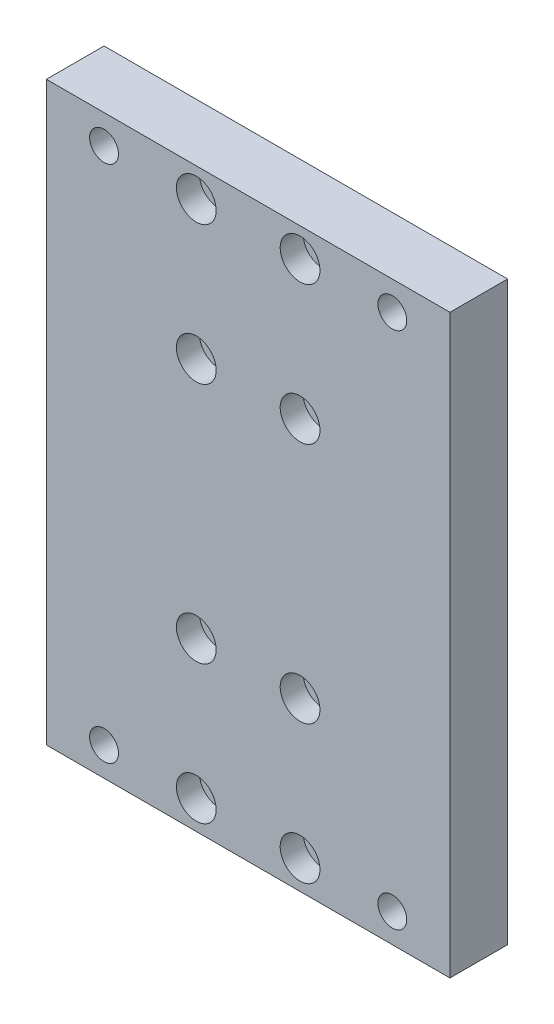
ISO-10303-21;
HEADER;
FILE_DESCRIPTION(('STEP AP214'),'2;1');
FILE_NAME('part.step','',(''),(''),'','','');
FILE_SCHEMA(('AUTOMOTIVE_DESIGN { 1 0 10303 214 1 1 1 1 }'));
ENDSEC;
DATA;
#1=APPLICATION_CONTEXT('core data for automotive mechanical design processes');
#2=APPLICATION_PROTOCOL_DEFINITION('international standard','automotive_design',2000,#1);
#3=PRODUCT_CONTEXT('',#1,'mechanical');
#4=PRODUCT('Part','Part','',(#3));
#5=PRODUCT_RELATED_PRODUCT_CATEGORY('part','',(#4));
#6=PRODUCT_DEFINITION_FORMATION('','',#4);
#7=PRODUCT_DEFINITION_CONTEXT('part definition',#1,'design');
#8=PRODUCT_DEFINITION('design','',#6,#7);
#9=PRODUCT_DEFINITION_SHAPE('','',#8);
#10=(LENGTH_UNIT() NAMED_UNIT(*) SI_UNIT(.MILLI.,.METRE.));
#11=(NAMED_UNIT(*) PLANE_ANGLE_UNIT() SI_UNIT($,.RADIAN.));
#12=(NAMED_UNIT(*) SI_UNIT($,.STERADIAN.) SOLID_ANGLE_UNIT());
#13=UNCERTAINTY_MEASURE_WITH_UNIT(LENGTH_MEASURE(1.E-05),#10,'distance_accuracy_value','');
#14=(GEOMETRIC_REPRESENTATION_CONTEXT(3) GLOBAL_UNCERTAINTY_ASSIGNED_CONTEXT((#13)) GLOBAL_UNIT_ASSIGNED_CONTEXT((#10,
#11,#12)) REPRESENTATION_CONTEXT('',''));
#15=CARTESIAN_POINT('',(0.,0.,0.));
#16=DIRECTION('',(0.,0.,1.));
#17=DIRECTION('',(1.,0.,0.));
#18=AXIS2_PLACEMENT_3D('',#15,#16,#17);
#19=CARTESIAN_POINT('',(-9.00000000000006,-20.9999999999998,10.));
#20=DIRECTION('',(0.,0.,-1.));
#21=DIRECTION('',(-1.,0.,0.));
#22=AXIS2_PLACEMENT_3D('',#19,#20,#21);
#23=CYLINDRICAL_SURFACE('',#22,1.5);
#24=CARTESIAN_POINT('',(-9.00000000000006,-20.9999999999998,0.));
#25=DIRECTION('',(0.,0.,-1.));
#26=DIRECTION('',(-1.,0.,0.));
#27=AXIS2_PLACEMENT_3D('',#24,#25,#26);
#28=CIRCLE('',#27,1.5);
#29=CARTESIAN_POINT('',(-10.5000000000001,-20.9999999999998,0.));
#30=VERTEX_POINT('',#29);
#31=EDGE_CURVE('E145',#30,#30,#28,.T.);
#32=ORIENTED_EDGE('',*,*,#31,.T.);
#33=EDGE_LOOP('',(#32));
#34=FACE_BOUND('',#33,.T.);
#35=CARTESIAN_POINT('',(-9.00000000000006,-20.9999999999998,6.));
#36=DIRECTION('',(0.,0.,1.));
#37=DIRECTION('',(1.,0.,0.));
#38=AXIS2_PLACEMENT_3D('',#35,#36,#37);
#39=CIRCLE('',#38,1.5);
#40=CARTESIAN_POINT('',(-7.50000000000006,-20.9999999999998,6.));
#41=VERTEX_POINT('',#40);
#42=EDGE_CURVE('E131',#41,#41,#39,.F.);
#43=ORIENTED_EDGE('',*,*,#42,.F.);
#44=EDGE_LOOP('',(#43));
#45=FACE_BOUND('',#44,.T.);
#46=ADVANCED_FACE('F37',(#34,#45),#23,.F.);
#47=CARTESIAN_POINT('',(8.99999999999985,-44.9999999999998,10.));
#48=DIRECTION('',(0.,0.,-1.));
#49=DIRECTION('',(-1.,0.,0.));
#50=AXIS2_PLACEMENT_3D('',#47,#48,#49);
#51=CYLINDRICAL_SURFACE('',#50,1.5);
#52=CARTESIAN_POINT('',(8.99999999999985,-44.9999999999998,0.));
#53=DIRECTION('',(0.,0.,-1.));
#54=DIRECTION('',(-1.,0.,0.));
#55=AXIS2_PLACEMENT_3D('',#52,#53,#54);
#56=CIRCLE('',#55,1.5);
#57=CARTESIAN_POINT('',(7.49999999999985,-44.9999999999998,0.));
#58=VERTEX_POINT('',#57);
#59=EDGE_CURVE('E140',#58,#58,#56,.T.);
#60=ORIENTED_EDGE('',*,*,#59,.T.);
#61=EDGE_LOOP('',(#60));
#62=FACE_BOUND('',#61,.T.);
#63=CARTESIAN_POINT('',(8.99999999999985,-44.9999999999998,6.));
#64=DIRECTION('',(0.,0.,1.));
#65=DIRECTION('',(1.,0.,0.));
#66=AXIS2_PLACEMENT_3D('',#63,#64,#65);
#67=CIRCLE('',#66,1.5);
#68=CARTESIAN_POINT('',(10.4999999999998,-44.9999999999998,6.));
#69=VERTEX_POINT('',#68);
#70=EDGE_CURVE('E129',#69,#69,#67,.F.);
#71=ORIENTED_EDGE('',*,*,#70,.F.);
#72=EDGE_LOOP('',(#71));
#73=FACE_BOUND('',#72,.T.);
#74=ADVANCED_FACE('F213',(#62,#73),#51,.F.);
#75=CARTESIAN_POINT('',(-8.99999999999984,45.0000000000002,10.));
#76=DIRECTION('',(0.,0.,-1.));
#77=DIRECTION('',(-1.,0.,0.));
#78=AXIS2_PLACEMENT_3D('',#75,#76,#77);
#79=CYLINDRICAL_SURFACE('',#78,1.5);
#80=CARTESIAN_POINT('',(-8.99999999999984,45.0000000000002,0.));
#81=DIRECTION('',(0.,0.,-1.));
#82=DIRECTION('',(-1.,0.,0.));
#83=AXIS2_PLACEMENT_3D('',#80,#81,#82);
#84=CIRCLE('',#83,1.5);
#85=CARTESIAN_POINT('',(-10.4999999999998,45.0000000000002,0.));
#86=VERTEX_POINT('',#85);
#87=EDGE_CURVE('E160',#86,#86,#84,.T.);
#88=ORIENTED_EDGE('',*,*,#87,.T.);
#89=EDGE_LOOP('',(#88));
#90=FACE_BOUND('',#89,.T.);
#91=CARTESIAN_POINT('',(-8.99999999999984,45.0000000000002,6.));
#92=DIRECTION('',(0.,0.,1.));
#93=DIRECTION('',(1.,0.,0.));
#94=AXIS2_PLACEMENT_3D('',#91,#92,#93);
#95=CIRCLE('',#94,1.5);
#96=CARTESIAN_POINT('',(-7.49999999999983,45.0000000000002,6.));
#97=VERTEX_POINT('',#96);
#98=EDGE_CURVE('E123',#97,#97,#95,.F.);
#99=ORIENTED_EDGE('',*,*,#98,.F.);
#100=EDGE_LOOP('',(#99));
#101=FACE_BOUND('',#100,.T.);
#102=ADVANCED_FACE('F220',(#90,#101),#79,.F.);
#103=CARTESIAN_POINT('',(9.00000000000008,21.0000000000002,10.));
#104=DIRECTION('',(0.,0.,-1.));
#105=DIRECTION('',(-1.,0.,0.));
#106=AXIS2_PLACEMENT_3D('',#103,#104,#105);
#107=CYLINDRICAL_SURFACE('',#106,1.5);
#108=CARTESIAN_POINT('',(9.00000000000008,21.0000000000002,0.));
#109=DIRECTION('',(0.,0.,-1.));
#110=DIRECTION('',(-1.,0.,0.));
#111=AXIS2_PLACEMENT_3D('',#108,#109,#110);
#112=CIRCLE('',#111,1.5);
#113=CARTESIAN_POINT('',(7.50000000000007,21.0000000000002,0.));
#114=VERTEX_POINT('',#113);
#115=EDGE_CURVE('E157',#114,#114,#112,.T.);
#116=ORIENTED_EDGE('',*,*,#115,.T.);
#117=EDGE_LOOP('',(#116));
#118=FACE_BOUND('',#117,.T.);
#119=CARTESIAN_POINT('',(9.00000000000008,21.0000000000002,6.));
#120=DIRECTION('',(0.,0.,1.));
#121=DIRECTION('',(1.,0.,0.));
#122=AXIS2_PLACEMENT_3D('',#119,#120,#121);
#123=CIRCLE('',#122,1.5);
#124=CARTESIAN_POINT('',(10.5000000000001,21.0000000000002,6.));
#125=VERTEX_POINT('',#124);
#126=EDGE_CURVE('E120',#125,#125,#123,.F.);
#127=ORIENTED_EDGE('',*,*,#126,.F.);
#128=EDGE_LOOP('',(#127));
#129=FACE_BOUND('',#128,.T.);
#130=ADVANCED_FACE('F239',(#118,#129),#107,.F.);
#131=CARTESIAN_POINT('',(-35.,-50.,10.));
#132=DIRECTION('',(1.,0.,0.));
#133=DIRECTION('',(0.,0.,-1.));
#134=AXIS2_PLACEMENT_3D('',#131,#132,#133);
#135=PLANE('',#134);
#136=DIRECTION('',(0.,-1.,0.));
#137=VECTOR('',#136,1.);
#138=CARTESIAN_POINT('',(-35.,-50.,0.));
#139=LINE('',#138,#137);
#140=CARTESIAN_POINT('',(-35.,50.,0.));
#141=VERTEX_POINT('',#140);
#142=CARTESIAN_POINT('',(-35.,-50.,0.));
#143=VERTEX_POINT('',#142);
#144=EDGE_CURVE('E104',#141,#143,#139,.T.);
#145=ORIENTED_EDGE('',*,*,#144,.T.);
#146=DIRECTION('',(0.,0.,-1.));
#147=VECTOR('',#146,1.);
#148=CARTESIAN_POINT('',(-35.,-50.,10.));
#149=LINE('',#148,#147);
#150=CARTESIAN_POINT('',(-35.,-50.,10.));
#151=VERTEX_POINT('',#150);
#152=EDGE_CURVE('E11',#151,#143,#149,.T.);
#153=ORIENTED_EDGE('',*,*,#152,.F.);
#154=DIRECTION('',(0.,-1.,0.));
#155=VECTOR('',#154,1.);
#156=CARTESIAN_POINT('',(-35.,-50.,10.));
#157=LINE('',#156,#155);
#158=CARTESIAN_POINT('',(-35.,50.,10.));
#159=VERTEX_POINT('',#158);
#160=EDGE_CURVE('E91',#159,#151,#157,.T.);
#161=ORIENTED_EDGE('',*,*,#160,.F.);
#162=DIRECTION('',(0.,0.,-1.));
#163=VECTOR('',#162,1.);
#164=CARTESIAN_POINT('',(-35.,50.,10.));
#165=LINE('',#164,#163);
#166=EDGE_CURVE('E100',#159,#141,#165,.T.);
#167=ORIENTED_EDGE('',*,*,#166,.T.);
#168=EDGE_LOOP('',(#145,#153,#161,#167));
#169=FACE_BOUND('',#168,.T.);
#170=ADVANCED_FACE('F39',(#169),#135,.F.);
#171=CARTESIAN_POINT('',(35.,-50.,10.));
#172=DIRECTION('',(0.,1.,0.));
#173=DIRECTION('',(-1.,0.,0.));
#174=AXIS2_PLACEMENT_3D('',#171,#172,#173);
#175=PLANE('',#174);
#176=DIRECTION('',(1.,0.,0.));
#177=VECTOR('',#176,1.);
#178=CARTESIAN_POINT('',(35.,-50.,0.));
#179=LINE('',#178,#177);
#180=CARTESIAN_POINT('',(35.,-50.,0.));
#181=VERTEX_POINT('',#180);
#182=EDGE_CURVE('E95',#143,#181,#179,.T.);
#183=ORIENTED_EDGE('',*,*,#182,.T.);
#184=DIRECTION('',(0.,0.,-1.));
#185=VECTOR('',#184,1.);
#186=CARTESIAN_POINT('',(35.,-50.,10.));
#187=LINE('',#186,#185);
#188=CARTESIAN_POINT('',(35.,-50.,10.));
#189=VERTEX_POINT('',#188);
#190=EDGE_CURVE('E47',#189,#181,#187,.T.);
#191=ORIENTED_EDGE('',*,*,#190,.F.);
#192=DIRECTION('',(1.,0.,0.));
#193=VECTOR('',#192,1.);
#194=CARTESIAN_POINT('',(35.,-50.,10.));
#195=LINE('',#194,#193);
#196=EDGE_CURVE('E86',#151,#189,#195,.T.);
#197=ORIENTED_EDGE('',*,*,#196,.F.);
#198=ORIENTED_EDGE('',*,*,#152,.T.);
#199=EDGE_LOOP('',(#183,#191,#197,#198));
#200=FACE_BOUND('',#199,.T.);
#201=ADVANCED_FACE('F94',(#200),#175,.F.);
#202=CARTESIAN_POINT('',(35.,-50.,10.));
#203=DIRECTION('',(-1.,0.,0.));
#204=DIRECTION('',(0.,0.,1.));
#205=AXIS2_PLACEMENT_3D('',#202,#203,#204);
#206=PLANE('',#205);
#207=DIRECTION('',(0.,1.,0.));
#208=VECTOR('',#207,1.);
#209=CARTESIAN_POINT('',(35.,-50.,0.));
#210=LINE('',#209,#208);
#211=CARTESIAN_POINT('',(35.,50.,0.));
#212=VERTEX_POINT('',#211);
#213=EDGE_CURVE('E73',#181,#212,#210,.T.);
#214=ORIENTED_EDGE('',*,*,#213,.T.);
#215=DIRECTION('',(0.,0.,-1.));
#216=VECTOR('',#215,1.);
#217=CARTESIAN_POINT('',(35.,50.,10.));
#218=LINE('',#217,#216);
#219=CARTESIAN_POINT('',(35.,50.,10.));
#220=VERTEX_POINT('',#219);
#221=EDGE_CURVE('E96',#220,#212,#218,.T.);
#222=ORIENTED_EDGE('',*,*,#221,.F.);
#223=DIRECTION('',(0.,1.,0.));
#224=VECTOR('',#223,1.);
#225=CARTESIAN_POINT('',(35.,-50.,10.));
#226=LINE('',#225,#224);
#227=EDGE_CURVE('E89',#189,#220,#226,.T.);
#228=ORIENTED_EDGE('',*,*,#227,.F.);
#229=ORIENTED_EDGE('',*,*,#190,.T.);
#230=EDGE_LOOP('',(#214,#222,#228,#229));
#231=FACE_BOUND('',#230,.T.);
#232=ADVANCED_FACE('F98',(#231),#206,.F.);
#233=CARTESIAN_POINT('',(35.,50.,10.));
#234=DIRECTION('',(0.,-1.,0.));
#235=DIRECTION('',(0.,0.,-1.));
#236=AXIS2_PLACEMENT_3D('',#233,#234,#235);
#237=PLANE('',#236);
#238=DIRECTION('',(-1.,0.,0.));
#239=VECTOR('',#238,1.);
#240=CARTESIAN_POINT('',(35.,50.,0.));
#241=LINE('',#240,#239);
#242=EDGE_CURVE('E79',#212,#141,#241,.T.);
#243=ORIENTED_EDGE('',*,*,#242,.T.);
#244=ORIENTED_EDGE('',*,*,#166,.F.);
#245=DIRECTION('',(-1.,0.,0.));
#246=VECTOR('',#245,1.);
#247=CARTESIAN_POINT('',(35.,50.,10.));
#248=LINE('',#247,#246);
#249=EDGE_CURVE('E56',#220,#159,#248,.T.);
#250=ORIENTED_EDGE('',*,*,#249,.F.);
#251=ORIENTED_EDGE('',*,*,#221,.T.);
#252=EDGE_LOOP('',(#243,#244,#250,#251));
#253=FACE_BOUND('',#252,.T.);
#254=ADVANCED_FACE('F201',(#253),#237,.F.);
#255=CARTESIAN_POINT('',(0.,0.,10.));
#256=DIRECTION('',(0.,0.,1.));
#257=DIRECTION('',(1.,0.,0.));
#258=AXIS2_PLACEMENT_3D('',#255,#256,#257);
#259=PLANE('',#258);
#260=CARTESIAN_POINT('',(8.99999999999983,-21.,10.));
#261=DIRECTION('',(0.,0.,1.));
#262=DIRECTION('',(-1.,0.,0.));
#263=AXIS2_PLACEMENT_3D('',#260,#261,#262);
#264=CIRCLE('',#263,3.45);
#265=CARTESIAN_POINT('',(5.54999999999983,-21.,10.));
#266=VERTEX_POINT('',#265);
#267=EDGE_CURVE('E583',#266,#266,#264,.T.);
#268=ORIENTED_EDGE('',*,*,#267,.F.);
#269=EDGE_LOOP('',(#268));
#270=FACE_BOUND('',#269,.T.);
#271=CARTESIAN_POINT('',(8.99999999999984,45.0000000000002,10.));
#272=DIRECTION('',(0.,0.,1.));
#273=DIRECTION('',(-1.,0.,0.));
#274=AXIS2_PLACEMENT_3D('',#271,#272,#273);
#275=CIRCLE('',#274,3.45);
#276=CARTESIAN_POINT('',(5.54999999999984,45.0000000000002,10.));
#277=VERTEX_POINT('',#276);
#278=EDGE_CURVE('E572',#277,#277,#275,.T.);
#279=ORIENTED_EDGE('',*,*,#278,.F.);
#280=EDGE_LOOP('',(#279));
#281=FACE_BOUND('',#280,.T.);
#282=CARTESIAN_POINT('',(8.99999999999984,21.,10.));
#283=DIRECTION('',(0.,0.,1.));
#284=DIRECTION('',(1.,0.,0.));
#285=AXIS2_PLACEMENT_3D('',#282,#283,#284);
#286=CIRCLE('',#285,3.45);
#287=CARTESIAN_POINT('',(12.4499999999998,21.,10.));
#288=VERTEX_POINT('',#287);
#289=EDGE_CURVE('E539',#288,#288,#286,.T.);
#290=ORIENTED_EDGE('',*,*,#289,.F.);
#291=EDGE_LOOP('',(#290));
#292=FACE_BOUND('',#291,.T.);
#293=CARTESIAN_POINT('',(-8.99999999999984,21.,10.));
#294=DIRECTION('',(0.,0.,1.));
#295=DIRECTION('',(-1.,0.,0.));
#296=AXIS2_PLACEMENT_3D('',#293,#294,#295);
#297=CIRCLE('',#296,3.45);
#298=CARTESIAN_POINT('',(-12.4499999999998,21.,10.));
#299=VERTEX_POINT('',#298);
#300=EDGE_CURVE('E533',#299,#299,#297,.T.);
#301=ORIENTED_EDGE('',*,*,#300,.F.);
#302=EDGE_LOOP('',(#301));
#303=FACE_BOUND('',#302,.T.);
#304=CARTESIAN_POINT('',(-8.99999999999984,-21.,10.));
#305=DIRECTION('',(0.,0.,1.));
#306=DIRECTION('',(1.,0.,0.));
#307=AXIS2_PLACEMENT_3D('',#304,#305,#306);
#308=CIRCLE('',#307,3.45);
#309=CARTESIAN_POINT('',(-5.54999999999984,-21.,10.));
#310=VERTEX_POINT('',#309);
#311=EDGE_CURVE('E589',#310,#310,#308,.T.);
#312=ORIENTED_EDGE('',*,*,#311,.F.);
#313=EDGE_LOOP('',(#312));
#314=FACE_BOUND('',#313,.T.);
#315=CARTESIAN_POINT('',(-8.99999999999985,-45.0000000000002,10.));
#316=DIRECTION('',(0.,0.,1.));
#317=DIRECTION('',(-1.,0.,0.));
#318=AXIS2_PLACEMENT_3D('',#315,#316,#317);
#319=CIRCLE('',#318,3.45);
#320=CARTESIAN_POINT('',(-12.4499999999999,-45.0000000000002,10.));
#321=VERTEX_POINT('',#320);
#322=EDGE_CURVE('E598',#321,#321,#319,.T.);
#323=ORIENTED_EDGE('',*,*,#322,.F.);
#324=EDGE_LOOP('',(#323));
#325=FACE_BOUND('',#324,.T.);
#326=CARTESIAN_POINT('',(8.99999999999982,-45.0000000000002,10.));
#327=DIRECTION('',(0.,0.,1.));
#328=DIRECTION('',(1.,0.,0.));
#329=AXIS2_PLACEMENT_3D('',#326,#327,#328);
#330=CIRCLE('',#329,3.45);
#331=CARTESIAN_POINT('',(12.4499999999998,-45.0000000000002,10.));
#332=VERTEX_POINT('',#331);
#333=EDGE_CURVE('E579',#332,#332,#330,.T.);
#334=ORIENTED_EDGE('',*,*,#333,.F.);
#335=EDGE_LOOP('',(#334));
#336=FACE_BOUND('',#335,.T.);
#337=CARTESIAN_POINT('',(-8.99999999999984,45.0000000000002,10.));
#338=DIRECTION('',(0.,0.,1.));
#339=DIRECTION('',(1.,0.,0.));
#340=AXIS2_PLACEMENT_3D('',#337,#338,#339);
#341=CIRCLE('',#340,3.45);
#342=CARTESIAN_POINT('',(-5.54999999999984,45.0000000000002,10.));
#343=VERTEX_POINT('',#342);
#344=EDGE_CURVE('E149',#343,#343,#341,.T.);
#345=ORIENTED_EDGE('',*,*,#344,.F.);
#346=EDGE_LOOP('',(#345));
#347=FACE_BOUND('',#346,.T.);
#348=CARTESIAN_POINT('',(-25.,45.,10.));
#349=DIRECTION('',(0.,0.,-1.));
#350=DIRECTION('',(1.,0.,0.));
#351=AXIS2_PLACEMENT_3D('',#348,#349,#350);
#352=CIRCLE('',#351,2.5);
#353=CARTESIAN_POINT('',(-22.5,45.,10.));
#354=VERTEX_POINT('',#353);
#355=EDGE_CURVE('E175',#354,#354,#352,.T.);
#356=ORIENTED_EDGE('',*,*,#355,.T.);
#357=EDGE_LOOP('',(#356));
#358=FACE_BOUND('',#357,.T.);
#359=CARTESIAN_POINT('',(25.,-45.,10.));
#360=DIRECTION('',(0.,0.,-1.));
#361=DIRECTION('',(1.,0.,0.));
#362=AXIS2_PLACEMENT_3D('',#359,#360,#361);
#363=CIRCLE('',#362,2.5);
#364=CARTESIAN_POINT('',(27.5,-45.,10.));
#365=VERTEX_POINT('',#364);
#366=EDGE_CURVE('E182',#365,#365,#363,.T.);
#367=ORIENTED_EDGE('',*,*,#366,.T.);
#368=EDGE_LOOP('',(#367));
#369=FACE_BOUND('',#368,.T.);
#370=CARTESIAN_POINT('',(-25.,-45.,10.));
#371=DIRECTION('',(0.,0.,-1.));
#372=DIRECTION('',(-1.,0.,0.));
#373=AXIS2_PLACEMENT_3D('',#370,#371,#372);
#374=CIRCLE('',#373,2.5);
#375=CARTESIAN_POINT('',(-27.5,-45.,10.));
#376=VERTEX_POINT('',#375);
#377=EDGE_CURVE('E169',#376,#376,#374,.T.);
#378=ORIENTED_EDGE('',*,*,#377,.T.);
#379=EDGE_LOOP('',(#378));
#380=FACE_BOUND('',#379,.T.);
#381=CARTESIAN_POINT('',(25.,45.,10.));
#382=DIRECTION('',(0.,0.,-1.));
#383=DIRECTION('',(-1.,0.,0.));
#384=AXIS2_PLACEMENT_3D('',#381,#382,#383);
#385=CIRCLE('',#384,2.5);
#386=CARTESIAN_POINT('',(22.5,45.,10.));
#387=VERTEX_POINT('',#386);
#388=EDGE_CURVE('E107',#387,#387,#385,.T.);
#389=ORIENTED_EDGE('',*,*,#388,.T.);
#390=EDGE_LOOP('',(#389));
#391=FACE_BOUND('',#390,.T.);
#392=ORIENTED_EDGE('',*,*,#160,.T.);
#393=ORIENTED_EDGE('',*,*,#196,.T.);
#394=ORIENTED_EDGE('',*,*,#227,.T.);
#395=ORIENTED_EDGE('',*,*,#249,.T.);
#396=EDGE_LOOP('',(#392,#393,#394,#395));
#397=FACE_BOUND('',#396,.T.);
#398=ADVANCED_FACE('F87',(#270,#281,#292,#303,#314,#325,#336,#347,#358,#369,#380,#391,#397),
#259,.T.);
#399=CARTESIAN_POINT('',(0.,0.,0.));
#400=DIRECTION('',(0.,0.,1.));
#401=DIRECTION('',(1.,0.,0.));
#402=AXIS2_PLACEMENT_3D('',#399,#400,#401);
#403=PLANE('',#402);
#404=CARTESIAN_POINT('',(-9.00000000000015,-44.9999999999998,0.));
#405=DIRECTION('',(0.,0.,-1.));
#406=DIRECTION('',(-1.,0.,0.));
#407=AXIS2_PLACEMENT_3D('',#404,#405,#406);
#408=CIRCLE('',#407,1.5);
#409=CARTESIAN_POINT('',(-10.5000000000002,-44.9999999999998,0.));
#410=VERTEX_POINT('',#409);
#411=EDGE_CURVE('E152',#410,#410,#408,.T.);
#412=ORIENTED_EDGE('',*,*,#411,.F.);
#413=EDGE_LOOP('',(#412));
#414=FACE_BOUND('',#413,.T.);
#415=CARTESIAN_POINT('',(9.00000000000016,45.0000000000002,0.));
#416=DIRECTION('',(0.,0.,-1.));
#417=DIRECTION('',(-1.,0.,0.));
#418=AXIS2_PLACEMENT_3D('',#415,#416,#417);
#419=CIRCLE('',#418,1.5);
#420=CARTESIAN_POINT('',(7.50000000000016,45.0000000000002,0.));
#421=VERTEX_POINT('',#420);
#422=EDGE_CURVE('E154',#421,#421,#419,.T.);
#423=ORIENTED_EDGE('',*,*,#422,.F.);
#424=EDGE_LOOP('',(#423));
#425=FACE_BOUND('',#424,.T.);
#426=ORIENTED_EDGE('',*,*,#115,.F.);
#427=EDGE_LOOP('',(#426));
#428=FACE_BOUND('',#427,.T.);
#429=ORIENTED_EDGE('',*,*,#87,.F.);
#430=EDGE_LOOP('',(#429));
#431=FACE_BOUND('',#430,.T.);
#432=CARTESIAN_POINT('',(8.99999999999993,-20.9999999999998,0.));
#433=DIRECTION('',(0.,0.,-1.));
#434=DIRECTION('',(-1.,0.,0.));
#435=AXIS2_PLACEMENT_3D('',#432,#433,#434);
#436=CIRCLE('',#435,1.5);
#437=CARTESIAN_POINT('',(7.49999999999993,-20.9999999999998,0.));
#438=VERTEX_POINT('',#437);
#439=EDGE_CURVE('E136',#438,#438,#436,.T.);
#440=ORIENTED_EDGE('',*,*,#439,.F.);
#441=EDGE_LOOP('',(#440));
#442=FACE_BOUND('',#441,.T.);
#443=ORIENTED_EDGE('',*,*,#59,.F.);
#444=EDGE_LOOP('',(#443));
#445=FACE_BOUND('',#444,.T.);
#446=ORIENTED_EDGE('',*,*,#31,.F.);
#447=EDGE_LOOP('',(#446));
#448=FACE_BOUND('',#447,.T.);
#449=CARTESIAN_POINT('',(-8.99999999999992,21.0000000000002,0.));
#450=DIRECTION('',(0.,0.,-1.));
#451=DIRECTION('',(-1.,0.,0.));
#452=AXIS2_PLACEMENT_3D('',#449,#450,#451);
#453=CIRCLE('',#452,1.5);
#454=CARTESIAN_POINT('',(-10.4999999999999,21.0000000000002,0.));
#455=VERTEX_POINT('',#454);
#456=EDGE_CURVE('E163',#455,#455,#453,.T.);
#457=ORIENTED_EDGE('',*,*,#456,.F.);
#458=EDGE_LOOP('',(#457));
#459=FACE_BOUND('',#458,.T.);
#460=CARTESIAN_POINT('',(-25.,45.,0.));
#461=DIRECTION('',(0.,0.,-1.));
#462=DIRECTION('',(1.,0.,0.));
#463=AXIS2_PLACEMENT_3D('',#460,#461,#462);
#464=CIRCLE('',#463,2.5);
#465=CARTESIAN_POINT('',(-22.5,45.,0.));
#466=VERTEX_POINT('',#465);
#467=EDGE_CURVE('E179',#466,#466,#464,.T.);
#468=ORIENTED_EDGE('',*,*,#467,.F.);
#469=EDGE_LOOP('',(#468));
#470=FACE_BOUND('',#469,.T.);
#471=CARTESIAN_POINT('',(25.,-45.,0.));
#472=DIRECTION('',(0.,0.,-1.));
#473=DIRECTION('',(1.,0.,0.));
#474=AXIS2_PLACEMENT_3D('',#471,#472,#473);
#475=CIRCLE('',#474,2.5);
#476=CARTESIAN_POINT('',(27.5,-45.,0.));
#477=VERTEX_POINT('',#476);
#478=EDGE_CURVE('E172',#477,#477,#475,.T.);
#479=ORIENTED_EDGE('',*,*,#478,.F.);
#480=EDGE_LOOP('',(#479));
#481=FACE_BOUND('',#480,.T.);
#482=CARTESIAN_POINT('',(-25.,-45.,0.));
#483=DIRECTION('',(0.,0.,-1.));
#484=DIRECTION('',(-1.,0.,0.));
#485=AXIS2_PLACEMENT_3D('',#482,#483,#484);
#486=CIRCLE('',#485,2.5);
#487=CARTESIAN_POINT('',(-27.5,-45.,0.));
#488=VERTEX_POINT('',#487);
#489=EDGE_CURVE('E168',#488,#488,#486,.T.);
#490=ORIENTED_EDGE('',*,*,#489,.F.);
#491=EDGE_LOOP('',(#490));
#492=FACE_BOUND('',#491,.T.);
#493=CARTESIAN_POINT('',(25.,45.,0.));
#494=DIRECTION('',(0.,0.,-1.));
#495=DIRECTION('',(-1.,0.,0.));
#496=AXIS2_PLACEMENT_3D('',#493,#494,#495);
#497=CIRCLE('',#496,2.5);
#498=CARTESIAN_POINT('',(22.5,45.,0.));
#499=VERTEX_POINT('',#498);
#500=EDGE_CURVE('E178',#499,#499,#497,.T.);
#501=ORIENTED_EDGE('',*,*,#500,.F.);
#502=EDGE_LOOP('',(#501));
#503=FACE_BOUND('',#502,.T.);
#504=ORIENTED_EDGE('',*,*,#144,.F.);
#505=ORIENTED_EDGE('',*,*,#242,.F.);
#506=ORIENTED_EDGE('',*,*,#213,.F.);
#507=ORIENTED_EDGE('',*,*,#182,.F.);
#508=EDGE_LOOP('',(#504,#505,#506,#507));
#509=FACE_BOUND('',#508,.T.);
#510=ADVANCED_FACE('F194',(#414,#425,#428,#431,#442,#445,#448,#459,#470,#481,#492,#503,#509),
#403,.F.);
#511=CARTESIAN_POINT('',(25.,45.,10.));
#512=DIRECTION('',(0.,0.,-1.));
#513=DIRECTION('',(-1.,0.,0.));
#514=AXIS2_PLACEMENT_3D('',#511,#512,#513);
#515=CYLINDRICAL_SURFACE('',#514,2.5);
#516=ORIENTED_EDGE('',*,*,#388,.F.);
#517=EDGE_LOOP('',(#516));
#518=FACE_BOUND('',#517,.T.);
#519=ORIENTED_EDGE('',*,*,#500,.T.);
#520=EDGE_LOOP('',(#519));
#521=FACE_BOUND('',#520,.T.);
#522=ADVANCED_FACE('F192',(#518,#521),#515,.F.);
#523=CARTESIAN_POINT('',(-25.,-45.,10.));
#524=DIRECTION('',(0.,0.,-1.));
#525=DIRECTION('',(-1.,0.,0.));
#526=AXIS2_PLACEMENT_3D('',#523,#524,#525);
#527=CYLINDRICAL_SURFACE('',#526,2.5);
#528=ORIENTED_EDGE('',*,*,#377,.F.);
#529=EDGE_LOOP('',(#528));
#530=FACE_BOUND('',#529,.T.);
#531=ORIENTED_EDGE('',*,*,#489,.T.);
#532=EDGE_LOOP('',(#531));
#533=FACE_BOUND('',#532,.T.);
#534=ADVANCED_FACE('F248',(#530,#533),#527,.F.);
#535=CARTESIAN_POINT('',(25.,-45.,10.));
#536=DIRECTION('',(0.,0.,-1.));
#537=DIRECTION('',(-1.,0.,0.));
#538=AXIS2_PLACEMENT_3D('',#535,#536,#537);
#539=CYLINDRICAL_SURFACE('',#538,2.5);
#540=ORIENTED_EDGE('',*,*,#366,.F.);
#541=EDGE_LOOP('',(#540));
#542=FACE_BOUND('',#541,.T.);
#543=ORIENTED_EDGE('',*,*,#478,.T.);
#544=EDGE_LOOP('',(#543));
#545=FACE_BOUND('',#544,.T.);
#546=ADVANCED_FACE('F251',(#542,#545),#539,.F.);
#547=CARTESIAN_POINT('',(-25.,45.,10.));
#548=DIRECTION('',(0.,0.,-1.));
#549=DIRECTION('',(-1.,0.,0.));
#550=AXIS2_PLACEMENT_3D('',#547,#548,#549);
#551=CYLINDRICAL_SURFACE('',#550,2.5);
#552=ORIENTED_EDGE('',*,*,#355,.F.);
#553=EDGE_LOOP('',(#552));
#554=FACE_BOUND('',#553,.T.);
#555=ORIENTED_EDGE('',*,*,#467,.T.);
#556=EDGE_LOOP('',(#555));
#557=FACE_BOUND('',#556,.T.);
#558=ADVANCED_FACE('F247',(#554,#557),#551,.F.);
#559=CARTESIAN_POINT('',(-8.99999999999992,21.0000000000002,10.));
#560=DIRECTION('',(0.,0.,-1.));
#561=DIRECTION('',(-1.,0.,0.));
#562=AXIS2_PLACEMENT_3D('',#559,#560,#561);
#563=CYLINDRICAL_SURFACE('',#562,1.5);
#564=CARTESIAN_POINT('',(-8.99999999999992,21.0000000000002,6.));
#565=DIRECTION('',(0.,0.,-1.));
#566=DIRECTION('',(-1.,0.,0.));
#567=AXIS2_PLACEMENT_3D('',#564,#565,#566);
#568=CIRCLE('',#567,1.5);
#569=CARTESIAN_POINT('',(-10.4999999999999,21.0000000000002,6.));
#570=VERTEX_POINT('',#569);
#571=EDGE_CURVE('E41',#570,#570,#568,.F.);
#572=ORIENTED_EDGE('',*,*,#571,.T.);
#573=EDGE_LOOP('',(#572));
#574=FACE_BOUND('',#573,.T.);
#575=ORIENTED_EDGE('',*,*,#456,.T.);
#576=EDGE_LOOP('',(#575));
#577=FACE_BOUND('',#576,.T.);
#578=ADVANCED_FACE('F244',(#574,#577),#563,.F.);
#579=CARTESIAN_POINT('',(8.99999999999993,-20.9999999999998,10.));
#580=DIRECTION('',(0.,0.,-1.));
#581=DIRECTION('',(-1.,0.,0.));
#582=AXIS2_PLACEMENT_3D('',#579,#580,#581);
#583=CYLINDRICAL_SURFACE('',#582,1.5);
#584=CARTESIAN_POINT('',(8.99999999999993,-20.9999999999998,6.));
#585=DIRECTION('',(0.,0.,-1.));
#586=DIRECTION('',(-1.,0.,0.));
#587=AXIS2_PLACEMENT_3D('',#584,#585,#586);
#588=CIRCLE('',#587,1.5);
#589=CARTESIAN_POINT('',(7.49999999999993,-20.9999999999998,6.));
#590=VERTEX_POINT('',#589);
#591=EDGE_CURVE('E126',#590,#590,#588,.F.);
#592=ORIENTED_EDGE('',*,*,#591,.T.);
#593=EDGE_LOOP('',(#592));
#594=FACE_BOUND('',#593,.T.);
#595=ORIENTED_EDGE('',*,*,#439,.T.);
#596=EDGE_LOOP('',(#595));
#597=FACE_BOUND('',#596,.T.);
#598=ADVANCED_FACE('F225',(#594,#597),#583,.F.);
#599=CARTESIAN_POINT('',(9.00000000000016,45.0000000000002,10.));
#600=DIRECTION('',(0.,0.,-1.));
#601=DIRECTION('',(-1.,0.,0.));
#602=AXIS2_PLACEMENT_3D('',#599,#600,#601);
#603=CYLINDRICAL_SURFACE('',#602,1.5);
#604=CARTESIAN_POINT('',(9.00000000000016,45.0000000000002,6.));
#605=DIRECTION('',(0.,0.,-1.));
#606=DIRECTION('',(-1.,0.,0.));
#607=AXIS2_PLACEMENT_3D('',#604,#605,#606);
#608=CIRCLE('',#607,1.5);
#609=CARTESIAN_POINT('',(7.50000000000016,45.0000000000002,6.));
#610=VERTEX_POINT('',#609);
#611=EDGE_CURVE('E116',#610,#610,#608,.F.);
#612=ORIENTED_EDGE('',*,*,#611,.T.);
#613=EDGE_LOOP('',(#612));
#614=FACE_BOUND('',#613,.T.);
#615=ORIENTED_EDGE('',*,*,#422,.T.);
#616=EDGE_LOOP('',(#615));
#617=FACE_BOUND('',#616,.T.);
#618=ADVANCED_FACE('F228',(#614,#617),#603,.F.);
#619=CARTESIAN_POINT('',(-9.00000000000015,-44.9999999999998,10.));
#620=DIRECTION('',(0.,0.,-1.));
#621=DIRECTION('',(-1.,0.,0.));
#622=AXIS2_PLACEMENT_3D('',#619,#620,#621);
#623=CYLINDRICAL_SURFACE('',#622,1.5);
#624=CARTESIAN_POINT('',(-9.00000000000015,-44.9999999999998,6.));
#625=DIRECTION('',(0.,0.,-1.));
#626=DIRECTION('',(-1.,0.,0.));
#627=AXIS2_PLACEMENT_3D('',#624,#625,#626);
#628=CIRCLE('',#627,1.5);
#629=CARTESIAN_POINT('',(-10.5000000000002,-44.9999999999998,6.));
#630=VERTEX_POINT('',#629);
#631=EDGE_CURVE('E113',#630,#630,#628,.F.);
#632=ORIENTED_EDGE('',*,*,#631,.T.);
#633=EDGE_LOOP('',(#632));
#634=FACE_BOUND('',#633,.T.);
#635=ORIENTED_EDGE('',*,*,#411,.T.);
#636=EDGE_LOOP('',(#635));
#637=FACE_BOUND('',#636,.T.);
#638=ADVANCED_FACE('F231',(#634,#637),#623,.F.);
#639=CARTESIAN_POINT('',(-8.99999999999985,-45.0000000000002,6.));
#640=DIRECTION('',(0.,0.,-1.));
#641=DIRECTION('',(-1.,0.,0.));
#642=AXIS2_PLACEMENT_3D('',#639,#640,#641);
#643=PLANE('',#642);
#644=CARTESIAN_POINT('',(-8.99999999999985,-45.0000000000002,6.));
#645=DIRECTION('',(0.,0.,1.));
#646=DIRECTION('',(-1.,0.,0.));
#647=AXIS2_PLACEMENT_3D('',#644,#645,#646);
#648=CIRCLE('',#647,3.45);
#649=CARTESIAN_POINT('',(-12.4499999999999,-45.0000000000002,6.));
#650=VERTEX_POINT('',#649);
#651=EDGE_CURVE('E593',#650,#650,#648,.T.);
#652=ORIENTED_EDGE('',*,*,#651,.T.);
#653=EDGE_LOOP('',(#652));
#654=FACE_BOUND('',#653,.T.);
#655=ORIENTED_EDGE('',*,*,#631,.F.);
#656=EDGE_LOOP('',(#655));
#657=FACE_BOUND('',#656,.T.);
#658=ADVANCED_FACE('F235',(#654,#657),#643,.F.);
#659=CARTESIAN_POINT('',(-8.99999999999985,-45.0000000000002,6.));
#660=DIRECTION('',(0.,0.,1.));
#661=DIRECTION('',(1.,0.,0.));
#662=AXIS2_PLACEMENT_3D('',#659,#660,#661);
#663=CYLINDRICAL_SURFACE('',#662,3.45);
#664=ORIENTED_EDGE('',*,*,#651,.F.);
#665=EDGE_LOOP('',(#664));
#666=FACE_BOUND('',#665,.T.);
#667=ORIENTED_EDGE('',*,*,#322,.T.);
#668=EDGE_LOOP('',(#667));
#669=FACE_BOUND('',#668,.T.);
#670=ADVANCED_FACE('F303',(#666,#669),#663,.F.);
#671=CARTESIAN_POINT('',(8.99999999999984,45.0000000000002,6.));
#672=DIRECTION('',(0.,0.,-1.));
#673=DIRECTION('',(-1.,0.,0.));
#674=AXIS2_PLACEMENT_3D('',#671,#672,#673);
#675=PLANE('',#674);
#676=CARTESIAN_POINT('',(8.99999999999984,45.0000000000002,6.));
#677=DIRECTION('',(0.,0.,1.));
#678=DIRECTION('',(-1.,0.,0.));
#679=AXIS2_PLACEMENT_3D('',#676,#677,#678);
#680=CIRCLE('',#679,3.45);
#681=CARTESIAN_POINT('',(5.54999999999984,45.0000000000002,6.));
#682=VERTEX_POINT('',#681);
#683=EDGE_CURVE('E544',#682,#682,#680,.T.);
#684=ORIENTED_EDGE('',*,*,#683,.T.);
#685=EDGE_LOOP('',(#684));
#686=FACE_BOUND('',#685,.T.);
#687=ORIENTED_EDGE('',*,*,#611,.F.);
#688=EDGE_LOOP('',(#687));
#689=FACE_BOUND('',#688,.T.);
#690=ADVANCED_FACE('F311',(#686,#689),#675,.F.);
#691=CARTESIAN_POINT('',(8.99999999999984,45.0000000000002,6.));
#692=DIRECTION('',(0.,0.,1.));
#693=DIRECTION('',(1.,0.,0.));
#694=AXIS2_PLACEMENT_3D('',#691,#692,#693);
#695=CYLINDRICAL_SURFACE('',#694,3.45);
#696=ORIENTED_EDGE('',*,*,#683,.F.);
#697=EDGE_LOOP('',(#696));
#698=FACE_BOUND('',#697,.T.);
#699=ORIENTED_EDGE('',*,*,#278,.T.);
#700=EDGE_LOOP('',(#699));
#701=FACE_BOUND('',#700,.T.);
#702=ADVANCED_FACE('F319',(#698,#701),#695,.F.);
#703=CARTESIAN_POINT('',(8.99999999999984,21.,6.));
#704=DIRECTION('',(0.,0.,1.));
#705=DIRECTION('',(1.,0.,0.));
#706=AXIS2_PLACEMENT_3D('',#703,#704,#705);
#707=PLANE('',#706);
#708=CARTESIAN_POINT('',(8.99999999999984,21.,6.));
#709=DIRECTION('',(0.,0.,1.));
#710=DIRECTION('',(1.,0.,0.));
#711=AXIS2_PLACEMENT_3D('',#708,#709,#710);
#712=CIRCLE('',#711,3.45);
#713=CARTESIAN_POINT('',(12.4499999999998,21.,6.));
#714=VERTEX_POINT('',#713);
#715=EDGE_CURVE('E535',#714,#714,#712,.T.);
#716=ORIENTED_EDGE('',*,*,#715,.T.);
#717=EDGE_LOOP('',(#716));
#718=FACE_BOUND('',#717,.T.);
#719=ORIENTED_EDGE('',*,*,#126,.T.);
#720=EDGE_LOOP('',(#719));
#721=FACE_BOUND('',#720,.T.);
#722=ADVANCED_FACE('F327',(#718,#721),#707,.T.);
#723=CARTESIAN_POINT('',(8.99999999999984,21.,6.));
#724=DIRECTION('',(0.,0.,1.));
#725=DIRECTION('',(1.,0.,0.));
#726=AXIS2_PLACEMENT_3D('',#723,#724,#725);
#727=CYLINDRICAL_SURFACE('',#726,3.45);
#728=ORIENTED_EDGE('',*,*,#715,.F.);
#729=EDGE_LOOP('',(#728));
#730=FACE_BOUND('',#729,.T.);
#731=ORIENTED_EDGE('',*,*,#289,.T.);
#732=EDGE_LOOP('',(#731));
#733=FACE_BOUND('',#732,.T.);
#734=ADVANCED_FACE('F335',(#730,#733),#727,.F.);
#735=CARTESIAN_POINT('',(-8.99999999999984,45.0000000000002,6.));
#736=DIRECTION('',(0.,0.,1.));
#737=DIRECTION('',(1.,0.,0.));
#738=AXIS2_PLACEMENT_3D('',#735,#736,#737);
#739=PLANE('',#738);
#740=CARTESIAN_POINT('',(-8.99999999999984,45.0000000000002,6.));
#741=DIRECTION('',(0.,0.,1.));
#742=DIRECTION('',(1.,0.,0.));
#743=AXIS2_PLACEMENT_3D('',#740,#741,#742);
#744=CIRCLE('',#743,3.45);
#745=CARTESIAN_POINT('',(-5.54999999999984,45.0000000000002,6.));
#746=VERTEX_POINT('',#745);
#747=EDGE_CURVE('E117',#746,#746,#744,.T.);
#748=ORIENTED_EDGE('',*,*,#747,.T.);
#749=EDGE_LOOP('',(#748));
#750=FACE_BOUND('',#749,.T.);
#751=ORIENTED_EDGE('',*,*,#98,.T.);
#752=EDGE_LOOP('',(#751));
#753=FACE_BOUND('',#752,.T.);
#754=ADVANCED_FACE('F343',(#750,#753),#739,.T.);
#755=CARTESIAN_POINT('',(-8.99999999999984,45.0000000000002,6.));
#756=DIRECTION('',(0.,0.,1.));
#757=DIRECTION('',(1.,0.,0.));
#758=AXIS2_PLACEMENT_3D('',#755,#756,#757);
#759=CYLINDRICAL_SURFACE('',#758,3.45);
#760=ORIENTED_EDGE('',*,*,#747,.F.);
#761=EDGE_LOOP('',(#760));
#762=FACE_BOUND('',#761,.T.);
#763=ORIENTED_EDGE('',*,*,#344,.T.);
#764=EDGE_LOOP('',(#763));
#765=FACE_BOUND('',#764,.T.);
#766=ADVANCED_FACE('F351',(#762,#765),#759,.F.);
#767=CARTESIAN_POINT('',(8.99999999999983,-21.,6.));
#768=DIRECTION('',(0.,0.,-1.));
#769=DIRECTION('',(-1.,0.,0.));
#770=AXIS2_PLACEMENT_3D('',#767,#768,#769);
#771=PLANE('',#770);
#772=CARTESIAN_POINT('',(8.99999999999983,-21.,6.));
#773=DIRECTION('',(0.,0.,1.));
#774=DIRECTION('',(-1.,0.,0.));
#775=AXIS2_PLACEMENT_3D('',#772,#773,#774);
#776=CIRCLE('',#775,3.45);
#777=CARTESIAN_POINT('',(5.54999999999983,-21.,6.));
#778=VERTEX_POINT('',#777);
#779=EDGE_CURVE('E576',#778,#778,#776,.T.);
#780=ORIENTED_EDGE('',*,*,#779,.T.);
#781=EDGE_LOOP('',(#780));
#782=FACE_BOUND('',#781,.T.);
#783=ORIENTED_EDGE('',*,*,#591,.F.);
#784=EDGE_LOOP('',(#783));
#785=FACE_BOUND('',#784,.T.);
#786=ADVANCED_FACE('F359',(#782,#785),#771,.F.);
#787=CARTESIAN_POINT('',(8.99999999999983,-21.,6.));
#788=DIRECTION('',(0.,0.,1.));
#789=DIRECTION('',(1.,0.,0.));
#790=AXIS2_PLACEMENT_3D('',#787,#788,#789);
#791=CYLINDRICAL_SURFACE('',#790,3.45);
#792=ORIENTED_EDGE('',*,*,#779,.F.);
#793=EDGE_LOOP('',(#792));
#794=FACE_BOUND('',#793,.T.);
#795=ORIENTED_EDGE('',*,*,#267,.T.);
#796=EDGE_LOOP('',(#795));
#797=FACE_BOUND('',#796,.T.);
#798=ADVANCED_FACE('F366',(#794,#797),#791,.F.);
#799=CARTESIAN_POINT('',(8.99999999999982,-45.0000000000002,6.));
#800=DIRECTION('',(0.,0.,1.));
#801=DIRECTION('',(1.,0.,0.));
#802=AXIS2_PLACEMENT_3D('',#799,#800,#801);
#803=PLANE('',#802);
#804=CARTESIAN_POINT('',(8.99999999999982,-45.0000000000002,6.));
#805=DIRECTION('',(0.,0.,1.));
#806=DIRECTION('',(1.,0.,0.));
#807=AXIS2_PLACEMENT_3D('',#804,#805,#806);
#808=CIRCLE('',#807,3.45);
#809=CARTESIAN_POINT('',(12.4499999999998,-45.0000000000002,6.));
#810=VERTEX_POINT('',#809);
#811=EDGE_CURVE('E600',#810,#810,#808,.T.);
#812=ORIENTED_EDGE('',*,*,#811,.T.);
#813=EDGE_LOOP('',(#812));
#814=FACE_BOUND('',#813,.T.);
#815=ORIENTED_EDGE('',*,*,#70,.T.);
#816=EDGE_LOOP('',(#815));
#817=FACE_BOUND('',#816,.T.);
#818=ADVANCED_FACE('F374',(#814,#817),#803,.T.);
#819=CARTESIAN_POINT('',(8.99999999999982,-45.0000000000002,6.));
#820=DIRECTION('',(0.,0.,1.));
#821=DIRECTION('',(1.,0.,0.));
#822=AXIS2_PLACEMENT_3D('',#819,#820,#821);
#823=CYLINDRICAL_SURFACE('',#822,3.45);
#824=ORIENTED_EDGE('',*,*,#811,.F.);
#825=EDGE_LOOP('',(#824));
#826=FACE_BOUND('',#825,.T.);
#827=ORIENTED_EDGE('',*,*,#333,.T.);
#828=EDGE_LOOP('',(#827));
#829=FACE_BOUND('',#828,.T.);
#830=ADVANCED_FACE('F382',(#826,#829),#823,.F.);
#831=CARTESIAN_POINT('',(-8.99999999999984,-21.,6.));
#832=DIRECTION('',(0.,0.,1.));
#833=DIRECTION('',(1.,0.,0.));
#834=AXIS2_PLACEMENT_3D('',#831,#832,#833);
#835=PLANE('',#834);
#836=CARTESIAN_POINT('',(-8.99999999999984,-21.,6.));
#837=DIRECTION('',(0.,0.,1.));
#838=DIRECTION('',(1.,0.,0.));
#839=AXIS2_PLACEMENT_3D('',#836,#837,#838);
#840=CIRCLE('',#839,3.45);
#841=CARTESIAN_POINT('',(-5.54999999999984,-21.,6.));
#842=VERTEX_POINT('',#841);
#843=EDGE_CURVE('E585',#842,#842,#840,.T.);
#844=ORIENTED_EDGE('',*,*,#843,.T.);
#845=EDGE_LOOP('',(#844));
#846=FACE_BOUND('',#845,.T.);
#847=ORIENTED_EDGE('',*,*,#42,.T.);
#848=EDGE_LOOP('',(#847));
#849=FACE_BOUND('',#848,.T.);
#850=ADVANCED_FACE('F390',(#846,#849),#835,.T.);
#851=CARTESIAN_POINT('',(-8.99999999999984,-21.,6.));
#852=DIRECTION('',(0.,0.,1.));
#853=DIRECTION('',(1.,0.,0.));
#854=AXIS2_PLACEMENT_3D('',#851,#852,#853);
#855=CYLINDRICAL_SURFACE('',#854,3.45);
#856=ORIENTED_EDGE('',*,*,#843,.F.);
#857=EDGE_LOOP('',(#856));
#858=FACE_BOUND('',#857,.T.);
#859=ORIENTED_EDGE('',*,*,#311,.T.);
#860=EDGE_LOOP('',(#859));
#861=FACE_BOUND('',#860,.T.);
#862=ADVANCED_FACE('F398',(#858,#861),#855,.F.);
#863=CARTESIAN_POINT('',(-8.99999999999984,21.,6.));
#864=DIRECTION('',(0.,0.,-1.));
#865=DIRECTION('',(-1.,0.,0.));
#866=AXIS2_PLACEMENT_3D('',#863,#864,#865);
#867=PLANE('',#866);
#868=CARTESIAN_POINT('',(-8.99999999999984,21.,6.));
#869=DIRECTION('',(0.,0.,1.));
#870=DIRECTION('',(-1.,0.,0.));
#871=AXIS2_PLACEMENT_3D('',#868,#869,#870);
#872=CIRCLE('',#871,3.45);
#873=CARTESIAN_POINT('',(-12.4499999999998,21.,6.));
#874=VERTEX_POINT('',#873);
#875=EDGE_CURVE('E530',#874,#874,#872,.T.);
#876=ORIENTED_EDGE('',*,*,#875,.T.);
#877=EDGE_LOOP('',(#876));
#878=FACE_BOUND('',#877,.T.);
#879=ORIENTED_EDGE('',*,*,#571,.F.);
#880=EDGE_LOOP('',(#879));
#881=FACE_BOUND('',#880,.T.);
#882=ADVANCED_FACE('F406',(#878,#881),#867,.F.);
#883=CARTESIAN_POINT('',(-8.99999999999984,21.,6.));
#884=DIRECTION('',(0.,0.,1.));
#885=DIRECTION('',(1.,0.,0.));
#886=AXIS2_PLACEMENT_3D('',#883,#884,#885);
#887=CYLINDRICAL_SURFACE('',#886,3.45);
#888=ORIENTED_EDGE('',*,*,#875,.F.);
#889=EDGE_LOOP('',(#888));
#890=FACE_BOUND('',#889,.T.);
#891=ORIENTED_EDGE('',*,*,#300,.T.);
#892=EDGE_LOOP('',(#891));
#893=FACE_BOUND('',#892,.T.);
#894=ADVANCED_FACE('F414',(#890,#893),#887,.F.);
#895=CLOSED_SHELL('',(#46,#74,#102,#130,#170,#201,#232,#254,#398,#510,#522,#534,#546,#558,#578,
#598,#618,#638,#658,#670,#690,#702,#722,#734,#754,#766,#786,#798,#818,#830,#850,#862,#882,#894));
#896=MANIFOLD_SOLID_BREP('B2',#895);
#897=ADVANCED_BREP_SHAPE_REPRESENTATION('',(#18,#896),#14);
#898=SHAPE_DEFINITION_REPRESENTATION(#9,#897);
ENDSEC;
END-ISO-10303-21;
